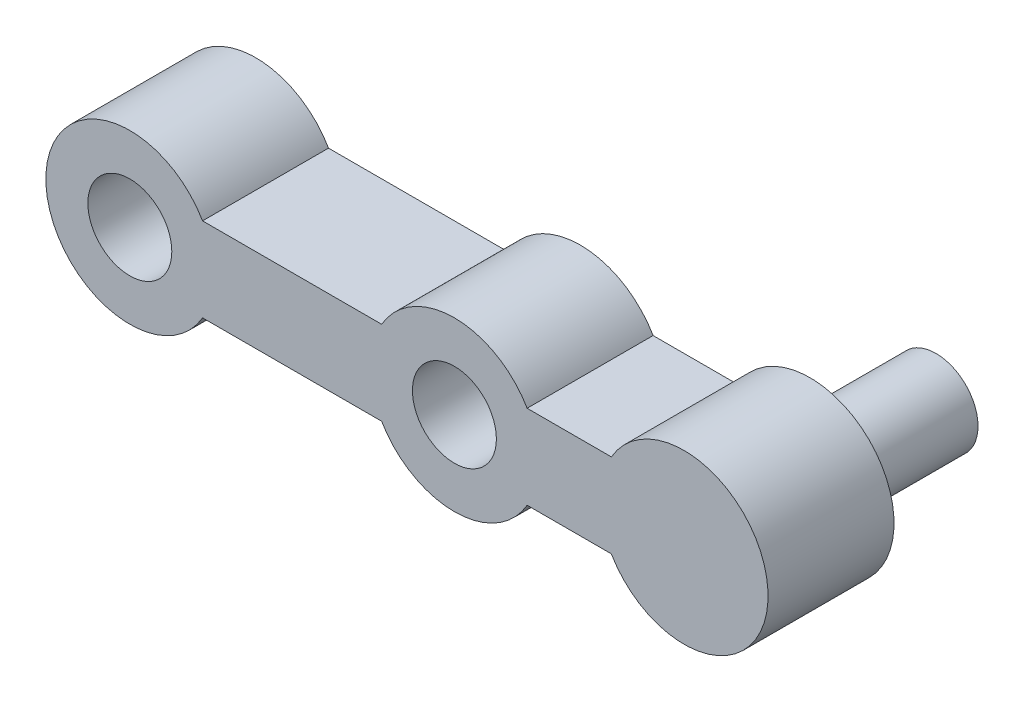
ISO-10303-21;
HEADER;
FILE_DESCRIPTION(('STEP AP214'),'2;1');
FILE_NAME('part.step','',(''),(''),'','','');
FILE_SCHEMA(('AUTOMOTIVE_DESIGN { 1 0 10303 214 1 1 1 1 }'));
ENDSEC;
DATA;
#1=APPLICATION_CONTEXT('core data for automotive mechanical design processes');
#2=APPLICATION_PROTOCOL_DEFINITION('international standard','automotive_design',2000,#1);
#3=PRODUCT_CONTEXT('',#1,'mechanical');
#4=PRODUCT('Part','Part','',(#3));
#5=PRODUCT_RELATED_PRODUCT_CATEGORY('part','',(#4));
#6=PRODUCT_DEFINITION_FORMATION('','',#4);
#7=PRODUCT_DEFINITION_CONTEXT('part definition',#1,'design');
#8=PRODUCT_DEFINITION('design','',#6,#7);
#9=PRODUCT_DEFINITION_SHAPE('','',#8);
#10=(LENGTH_UNIT() NAMED_UNIT(*) SI_UNIT(.MILLI.,.METRE.));
#11=(NAMED_UNIT(*) PLANE_ANGLE_UNIT() SI_UNIT($,.RADIAN.));
#12=(NAMED_UNIT(*) SI_UNIT($,.STERADIAN.) SOLID_ANGLE_UNIT());
#13=UNCERTAINTY_MEASURE_WITH_UNIT(LENGTH_MEASURE(1.E-05),#10,'distance_accuracy_value','');
#14=(GEOMETRIC_REPRESENTATION_CONTEXT(3) GLOBAL_UNCERTAINTY_ASSIGNED_CONTEXT((#13)) GLOBAL_UNIT_ASSIGNED_CONTEXT((#10,
#11,#12)) REPRESENTATION_CONTEXT('',''));
#15=CARTESIAN_POINT('',(0.,0.,0.));
#16=DIRECTION('',(0.,0.,1.));
#17=DIRECTION('',(1.,0.,0.));
#18=AXIS2_PLACEMENT_3D('',#15,#16,#17);
#19=CARTESIAN_POINT('',(0.,-4.82265468207547,3.));
#20=DIRECTION('',(0.,1.,0.));
#21=DIRECTION('',(0.,0.,1.));
#22=AXIS2_PLACEMENT_3D('',#19,#20,#21);
#23=PLANE('',#22);
#24=DIRECTION('',(1.,0.,0.));
#25=VECTOR('',#24,1.);
#26=CARTESIAN_POINT('',(0.,-4.82265468207547,0.));
#27=LINE('',#26,#25);
#28=CARTESIAN_POINT('',(-9.64886000168167,-4.82265468207547,0.));
#29=VERTEX_POINT('',#28);
#30=CARTESIAN_POINT('',(-7.64296161681943,-4.82265468207547,0.));
#31=VERTEX_POINT('',#30);
#32=EDGE_CURVE('E131',#29,#31,#27,.T.);
#33=ORIENTED_EDGE('',*,*,#32,.F.);
#34=DIRECTION('',(0.,0.,-1.));
#35=VECTOR('',#34,1.);
#36=CARTESIAN_POINT('',(-9.64886000168167,-4.82265468207547,3.));
#37=LINE('',#36,#35);
#38=CARTESIAN_POINT('',(-9.64886000168167,-4.82265468207547,3.));
#39=VERTEX_POINT('',#38);
#40=EDGE_CURVE('E45',#39,#29,#37,.T.);
#41=ORIENTED_EDGE('',*,*,#40,.F.);
#42=DIRECTION('',(1.,0.,0.));
#43=VECTOR('',#42,1.);
#44=CARTESIAN_POINT('',(0.,-4.82265468207547,3.));
#45=LINE('',#44,#43);
#46=CARTESIAN_POINT('',(-7.64296161681943,-4.82265468207547,3.));
#47=VERTEX_POINT('',#46);
#48=EDGE_CURVE('E149',#39,#47,#45,.T.);
#49=ORIENTED_EDGE('',*,*,#48,.T.);
#50=DIRECTION('',(0.,0.,-1.));
#51=VECTOR('',#50,1.);
#52=CARTESIAN_POINT('',(-7.64296161681943,-4.82265468207547,3.));
#53=LINE('',#52,#51);
#54=EDGE_CURVE('E89',#47,#31,#53,.T.);
#55=ORIENTED_EDGE('',*,*,#54,.T.);
#56=EDGE_LOOP('',(#33,#41,#49,#55));
#57=FACE_BOUND('',#56,.T.);
#58=ADVANCED_FACE('F37',(#57),#23,.T.);
#59=CARTESIAN_POINT('',(-11.3809108092505,-5.82265468207547,3.));
#60=DIRECTION('',(0.,0.,-1.));
#61=DIRECTION('',(-1.,0.,0.));
#62=AXIS2_PLACEMENT_3D('',#59,#60,#61);
#63=CYLINDRICAL_SURFACE('',#62,2.);
#64=CARTESIAN_POINT('',(-11.3809108092505,-5.82265468207547,0.));
#65=DIRECTION('',(0.,0.,1.));
#66=DIRECTION('',(1.,0.,0.));
#67=AXIS2_PLACEMENT_3D('',#64,#65,#66);
#68=CIRCLE('',#67,2.);
#69=CARTESIAN_POINT('',(-13.1129616168194,-4.82265468207547,0.));
#70=VERTEX_POINT('',#69);
#71=EDGE_CURVE('E134',#29,#70,#68,.T.);
#72=ORIENTED_EDGE('',*,*,#71,.T.);
#73=DIRECTION('',(0.,0.,-1.));
#74=VECTOR('',#73,1.);
#75=CARTESIAN_POINT('',(-13.1129616168194,-4.82265468207547,3.));
#76=LINE('',#75,#74);
#77=CARTESIAN_POINT('',(-13.1129616168194,-4.82265468207547,3.));
#78=VERTEX_POINT('',#77);
#79=EDGE_CURVE('E158',#78,#70,#76,.T.);
#80=ORIENTED_EDGE('',*,*,#79,.F.);
#81=CARTESIAN_POINT('',(-11.3809108092505,-5.82265468207547,3.));
#82=DIRECTION('',(0.,0.,1.));
#83=DIRECTION('',(1.,0.,0.));
#84=AXIS2_PLACEMENT_3D('',#81,#82,#83);
#85=CIRCLE('',#84,2.);
#86=EDGE_CURVE('E163',#39,#78,#85,.T.);
#87=ORIENTED_EDGE('',*,*,#86,.F.);
#88=ORIENTED_EDGE('',*,*,#40,.T.);
#89=EDGE_LOOP('',(#72,#80,#87,#88));
#90=FACE_BOUND('',#89,.T.);
#91=ADVANCED_FACE('F161',(#90),#63,.T.);
#92=CARTESIAN_POINT('',(0.,-4.82265468207548,3.));
#93=DIRECTION('',(0.,1.,0.));
#94=DIRECTION('',(-1.,0.,0.));
#95=AXIS2_PLACEMENT_3D('',#92,#93,#94);
#96=PLANE('',#95);
#97=DIRECTION('',(1.,0.,0.));
#98=VECTOR('',#97,1.);
#99=CARTESIAN_POINT('',(0.,-4.82265468207548,0.));
#100=LINE('',#99,#98);
#101=CARTESIAN_POINT('',(-17.3788600016817,-4.82265468207547,0.));
#102=VERTEX_POINT('',#101);
#103=EDGE_CURVE('E138',#102,#70,#100,.T.);
#104=ORIENTED_EDGE('',*,*,#103,.F.);
#105=DIRECTION('',(0.,0.,-1.));
#106=VECTOR('',#105,1.);
#107=CARTESIAN_POINT('',(-17.3788600016817,-4.82265468207547,3.));
#108=LINE('',#107,#106);
#109=CARTESIAN_POINT('',(-17.3788600016817,-4.82265468207547,3.));
#110=VERTEX_POINT('',#109);
#111=EDGE_CURVE('E156',#110,#102,#108,.T.);
#112=ORIENTED_EDGE('',*,*,#111,.F.);
#113=DIRECTION('',(1.,0.,0.));
#114=VECTOR('',#113,1.);
#115=CARTESIAN_POINT('',(0.,-4.82265468207548,3.));
#116=LINE('',#115,#114);
#117=EDGE_CURVE('E237',#110,#78,#116,.T.);
#118=ORIENTED_EDGE('',*,*,#117,.T.);
#119=ORIENTED_EDGE('',*,*,#79,.T.);
#120=EDGE_LOOP('',(#104,#112,#118,#119));
#121=FACE_BOUND('',#120,.T.);
#122=ADVANCED_FACE('F173',(#121),#96,.T.);
#123=CARTESIAN_POINT('',(-19.1109108092506,-5.82265468207547,3.));
#124=DIRECTION('',(0.,0.,-1.));
#125=DIRECTION('',(-1.,0.,0.));
#126=AXIS2_PLACEMENT_3D('',#123,#124,#125);
#127=CYLINDRICAL_SURFACE('',#126,2.);
#128=CARTESIAN_POINT('',(-19.1109108092506,-5.82265468207547,0.));
#129=DIRECTION('',(0.,0.,1.));
#130=DIRECTION('',(1.,0.,0.));
#131=AXIS2_PLACEMENT_3D('',#128,#129,#130);
#132=CIRCLE('',#131,2.);
#133=CARTESIAN_POINT('',(-17.3788600016817,-6.82265468207547,0.));
#134=VERTEX_POINT('',#133);
#135=EDGE_CURVE('E141',#102,#134,#132,.T.);
#136=ORIENTED_EDGE('',*,*,#135,.T.);
#137=DIRECTION('',(0.,0.,-1.));
#138=VECTOR('',#137,1.);
#139=CARTESIAN_POINT('',(-17.3788600016817,-6.82265468207547,3.));
#140=LINE('',#139,#138);
#141=CARTESIAN_POINT('',(-17.3788600016817,-6.82265468207547,3.));
#142=VERTEX_POINT('',#141);
#143=EDGE_CURVE('E153',#142,#134,#140,.T.);
#144=ORIENTED_EDGE('',*,*,#143,.F.);
#145=CARTESIAN_POINT('',(-19.1109108092506,-5.82265468207547,3.));
#146=DIRECTION('',(0.,0.,1.));
#147=DIRECTION('',(1.,0.,0.));
#148=AXIS2_PLACEMENT_3D('',#145,#146,#147);
#149=CIRCLE('',#148,2.);
#150=EDGE_CURVE('E240',#110,#142,#149,.T.);
#151=ORIENTED_EDGE('',*,*,#150,.F.);
#152=ORIENTED_EDGE('',*,*,#111,.T.);
#153=EDGE_LOOP('',(#136,#144,#151,#152));
#154=FACE_BOUND('',#153,.T.);
#155=ADVANCED_FACE('F177',(#154),#127,.T.);
#156=CARTESIAN_POINT('',(0.,-6.82265468207547,3.));
#157=DIRECTION('',(0.,1.,0.));
#158=DIRECTION('',(0.,0.,1.));
#159=AXIS2_PLACEMENT_3D('',#156,#157,#158);
#160=PLANE('',#159);
#161=DIRECTION('',(1.,0.,0.));
#162=VECTOR('',#161,1.);
#163=CARTESIAN_POINT('',(0.,-6.82265468207547,0.));
#164=LINE('',#163,#162);
#165=CARTESIAN_POINT('',(-13.1129616168194,-6.82265468207547,0.));
#166=VERTEX_POINT('',#165);
#167=EDGE_CURVE('E143',#134,#166,#164,.T.);
#168=ORIENTED_EDGE('',*,*,#167,.T.);
#169=DIRECTION('',(0.,0.,-1.));
#170=VECTOR('',#169,1.);
#171=CARTESIAN_POINT('',(-13.1129616168194,-6.82265468207547,3.));
#172=LINE('',#171,#170);
#173=CARTESIAN_POINT('',(-13.1129616168194,-6.82265468207547,3.));
#174=VERTEX_POINT('',#173);
#175=EDGE_CURVE('E123',#174,#166,#172,.T.);
#176=ORIENTED_EDGE('',*,*,#175,.F.);
#177=DIRECTION('',(1.,0.,0.));
#178=VECTOR('',#177,1.);
#179=CARTESIAN_POINT('',(0.,-6.82265468207547,3.));
#180=LINE('',#179,#178);
#181=EDGE_CURVE('E114',#142,#174,#180,.T.);
#182=ORIENTED_EDGE('',*,*,#181,.F.);
#183=ORIENTED_EDGE('',*,*,#143,.T.);
#184=EDGE_LOOP('',(#168,#176,#182,#183));
#185=FACE_BOUND('',#184,.T.);
#186=ADVANCED_FACE('F183',(#185),#160,.F.);
#187=CARTESIAN_POINT('',(-11.3809108092505,-5.82265468207547,3.));
#188=DIRECTION('',(0.,0.,-1.));
#189=DIRECTION('',(-1.,0.,0.));
#190=AXIS2_PLACEMENT_3D('',#187,#188,#189);
#191=CYLINDRICAL_SURFACE('',#190,2.);
#192=CARTESIAN_POINT('',(-11.3809108092505,-5.82265468207547,0.));
#193=DIRECTION('',(0.,0.,1.));
#194=DIRECTION('',(1.,0.,0.));
#195=AXIS2_PLACEMENT_3D('',#192,#193,#194);
#196=CIRCLE('',#195,2.);
#197=CARTESIAN_POINT('',(-9.64886000168167,-6.82265468207547,0.));
#198=VERTEX_POINT('',#197);
#199=EDGE_CURVE('E122',#166,#198,#196,.T.);
#200=ORIENTED_EDGE('',*,*,#199,.T.);
#201=DIRECTION('',(0.,0.,-1.));
#202=VECTOR('',#201,1.);
#203=CARTESIAN_POINT('',(-9.64886000168167,-6.82265468207547,3.));
#204=LINE('',#203,#202);
#205=CARTESIAN_POINT('',(-9.64886000168167,-6.82265468207547,3.));
#206=VERTEX_POINT('',#205);
#207=EDGE_CURVE('E119',#206,#198,#204,.T.);
#208=ORIENTED_EDGE('',*,*,#207,.F.);
#209=CARTESIAN_POINT('',(-11.3809108092505,-5.82265468207547,3.));
#210=DIRECTION('',(0.,0.,1.));
#211=DIRECTION('',(1.,0.,0.));
#212=AXIS2_PLACEMENT_3D('',#209,#210,#211);
#213=CIRCLE('',#212,2.);
#214=EDGE_CURVE('E108',#174,#206,#213,.T.);
#215=ORIENTED_EDGE('',*,*,#214,.F.);
#216=ORIENTED_EDGE('',*,*,#175,.T.);
#217=EDGE_LOOP('',(#200,#208,#215,#216));
#218=FACE_BOUND('',#217,.T.);
#219=ADVANCED_FACE('F120',(#218),#191,.T.);
#220=CARTESIAN_POINT('',(0.,-6.82265468207547,3.));
#221=DIRECTION('',(0.,1.,0.));
#222=DIRECTION('',(0.,0.,1.));
#223=AXIS2_PLACEMENT_3D('',#220,#221,#222);
#224=PLANE('',#223);
#225=DIRECTION('',(1.,0.,0.));
#226=VECTOR('',#225,1.);
#227=CARTESIAN_POINT('',(0.,-6.82265468207547,0.));
#228=LINE('',#227,#226);
#229=CARTESIAN_POINT('',(-7.64296161681943,-6.82265468207547,0.));
#230=VERTEX_POINT('',#229);
#231=EDGE_CURVE('E82',#198,#230,#228,.T.);
#232=ORIENTED_EDGE('',*,*,#231,.T.);
#233=DIRECTION('',(0.,0.,-1.));
#234=VECTOR('',#233,1.);
#235=CARTESIAN_POINT('',(-7.64296161681943,-6.82265468207547,3.));
#236=LINE('',#235,#234);
#237=CARTESIAN_POINT('',(-7.64296161681943,-6.82265468207547,3.));
#238=VERTEX_POINT('',#237);
#239=EDGE_CURVE('E124',#238,#230,#236,.T.);
#240=ORIENTED_EDGE('',*,*,#239,.F.);
#241=DIRECTION('',(1.,0.,0.));
#242=VECTOR('',#241,1.);
#243=CARTESIAN_POINT('',(0.,-6.82265468207547,3.));
#244=LINE('',#243,#242);
#245=EDGE_CURVE('E112',#206,#238,#244,.T.);
#246=ORIENTED_EDGE('',*,*,#245,.F.);
#247=ORIENTED_EDGE('',*,*,#207,.T.);
#248=EDGE_LOOP('',(#232,#240,#246,#247));
#249=FACE_BOUND('',#248,.T.);
#250=ADVANCED_FACE('F126',(#249),#224,.F.);
#251=CARTESIAN_POINT('',(-5.91091080925055,-5.82265468207548,3.));
#252=DIRECTION('',(0.,0.,-1.));
#253=DIRECTION('',(-1.,0.,0.));
#254=AXIS2_PLACEMENT_3D('',#251,#252,#253);
#255=CYLINDRICAL_SURFACE('',#254,2.);
#256=CARTESIAN_POINT('',(-5.91091080925055,-5.82265468207548,0.));
#257=DIRECTION('',(0.,0.,1.));
#258=DIRECTION('',(1.,0.,0.));
#259=AXIS2_PLACEMENT_3D('',#256,#257,#258);
#260=CIRCLE('',#259,2.);
#261=EDGE_CURVE('E147',#230,#31,#260,.T.);
#262=ORIENTED_EDGE('',*,*,#261,.T.);
#263=ORIENTED_EDGE('',*,*,#54,.F.);
#264=CARTESIAN_POINT('',(-5.91091080925055,-5.82265468207548,3.));
#265=DIRECTION('',(0.,0.,1.));
#266=DIRECTION('',(1.,0.,0.));
#267=AXIS2_PLACEMENT_3D('',#264,#265,#266);
#268=CIRCLE('',#267,2.);
#269=EDGE_CURVE('E53',#238,#47,#268,.T.);
#270=ORIENTED_EDGE('',*,*,#269,.F.);
#271=ORIENTED_EDGE('',*,*,#239,.T.);
#272=EDGE_LOOP('',(#262,#263,#270,#271));
#273=FACE_BOUND('',#272,.T.);
#274=ADVANCED_FACE('F192',(#273),#255,.T.);
#275=CARTESIAN_POINT('',(0.,0.,3.));
#276=DIRECTION('',(0.,0.,1.));
#277=DIRECTION('',(1.,0.,0.));
#278=AXIS2_PLACEMENT_3D('',#275,#276,#277);
#279=PLANE('',#278);
#280=CARTESIAN_POINT('',(-11.3809108092505,-5.82265468207547,3.));
#281=DIRECTION('',(0.,0.,1.));
#282=DIRECTION('',(1.,0.,0.));
#283=AXIS2_PLACEMENT_3D('',#280,#281,#282);
#284=CIRCLE('',#283,1.);
#285=CARTESIAN_POINT('',(-10.3809108092506,-5.82265468207547,3.));
#286=VERTEX_POINT('',#285);
#287=EDGE_CURVE('E228',#286,#286,#284,.T.);
#288=ORIENTED_EDGE('',*,*,#287,.F.);
#289=EDGE_LOOP('',(#288));
#290=FACE_BOUND('',#289,.T.);
#291=CARTESIAN_POINT('',(-19.1109108092506,-5.82265468207547,3.));
#292=DIRECTION('',(0.,0.,1.));
#293=DIRECTION('',(1.,0.,0.));
#294=AXIS2_PLACEMENT_3D('',#291,#292,#293);
#295=CIRCLE('',#294,1.);
#296=CARTESIAN_POINT('',(-18.1109108092505,-5.82265468207547,3.));
#297=VERTEX_POINT('',#296);
#298=EDGE_CURVE('E225',#297,#297,#295,.T.);
#299=ORIENTED_EDGE('',*,*,#298,.F.);
#300=EDGE_LOOP('',(#299));
#301=FACE_BOUND('',#300,.T.);
#302=ORIENTED_EDGE('',*,*,#48,.F.);
#303=ORIENTED_EDGE('',*,*,#86,.T.);
#304=ORIENTED_EDGE('',*,*,#117,.F.);
#305=ORIENTED_EDGE('',*,*,#150,.T.);
#306=ORIENTED_EDGE('',*,*,#181,.T.);
#307=ORIENTED_EDGE('',*,*,#214,.T.);
#308=ORIENTED_EDGE('',*,*,#245,.T.);
#309=ORIENTED_EDGE('',*,*,#269,.T.);
#310=EDGE_LOOP('',(#302,#303,#304,#305,#306,#307,#308,#309));
#311=FACE_BOUND('',#310,.T.);
#312=ADVANCED_FACE('F110',(#290,#301,#311),#279,.T.);
#313=CARTESIAN_POINT('',(0.,0.,0.));
#314=DIRECTION('',(0.,0.,1.));
#315=DIRECTION('',(1.,0.,0.));
#316=AXIS2_PLACEMENT_3D('',#313,#314,#315);
#317=PLANE('',#316);
#318=CARTESIAN_POINT('',(-5.91091080925055,-5.82265468207548,0.));
#319=DIRECTION('',(0.,0.,1.));
#320=DIRECTION('',(1.,0.,0.));
#321=AXIS2_PLACEMENT_3D('',#318,#319,#320);
#322=CIRCLE('',#321,1.);
#323=CARTESIAN_POINT('',(-4.91091080925055,-5.82265468207548,0.));
#324=VERTEX_POINT('',#323);
#325=EDGE_CURVE('E11',#324,#324,#322,.F.);
#326=ORIENTED_EDGE('',*,*,#325,.F.);
#327=EDGE_LOOP('',(#326));
#328=FACE_BOUND('',#327,.T.);
#329=CARTESIAN_POINT('',(-11.3809108092505,-5.82265468207547,0.));
#330=DIRECTION('',(0.,0.,1.));
#331=DIRECTION('',(1.,0.,0.));
#332=AXIS2_PLACEMENT_3D('',#329,#330,#331);
#333=CIRCLE('',#332,1.);
#334=CARTESIAN_POINT('',(-10.3809108092506,-5.82265468207547,0.));
#335=VERTEX_POINT('',#334);
#336=EDGE_CURVE('E135',#335,#335,#333,.F.);
#337=ORIENTED_EDGE('',*,*,#336,.F.);
#338=EDGE_LOOP('',(#337));
#339=FACE_BOUND('',#338,.T.);
#340=CARTESIAN_POINT('',(-19.1109108092506,-5.82265468207547,0.));
#341=DIRECTION('',(0.,0.,1.));
#342=DIRECTION('',(1.,0.,0.));
#343=AXIS2_PLACEMENT_3D('',#340,#341,#342);
#344=CIRCLE('',#343,1.);
#345=CARTESIAN_POINT('',(-18.1109108092505,-5.82265468207547,0.));
#346=VERTEX_POINT('',#345);
#347=EDGE_CURVE('E222',#346,#346,#344,.F.);
#348=ORIENTED_EDGE('',*,*,#347,.F.);
#349=EDGE_LOOP('',(#348));
#350=FACE_BOUND('',#349,.T.);
#351=ORIENTED_EDGE('',*,*,#32,.T.);
#352=ORIENTED_EDGE('',*,*,#261,.F.);
#353=ORIENTED_EDGE('',*,*,#231,.F.);
#354=ORIENTED_EDGE('',*,*,#199,.F.);
#355=ORIENTED_EDGE('',*,*,#167,.F.);
#356=ORIENTED_EDGE('',*,*,#135,.F.);
#357=ORIENTED_EDGE('',*,*,#103,.T.);
#358=ORIENTED_EDGE('',*,*,#71,.F.);
#359=EDGE_LOOP('',(#351,#352,#353,#354,#355,#356,#357,#358));
#360=FACE_BOUND('',#359,.T.);
#361=ADVANCED_FACE('F165',(#328,#339,#350,#360),#317,.F.);
#362=CARTESIAN_POINT('',(-19.1109108092506,-5.82265468207547,-2.82842712474619));
#363=DIRECTION('',(0.,0.,1.));
#364=DIRECTION('',(1.,0.,0.));
#365=AXIS2_PLACEMENT_3D('',#362,#363,#364);
#366=CYLINDRICAL_SURFACE('',#365,1.);
#367=ORIENTED_EDGE('',*,*,#347,.T.);
#368=EDGE_LOOP('',(#367));
#369=FACE_BOUND('',#368,.T.);
#370=ORIENTED_EDGE('',*,*,#298,.T.);
#371=EDGE_LOOP('',(#370));
#372=FACE_BOUND('',#371,.T.);
#373=ADVANCED_FACE('F198',(#369,#372),#366,.F.);
#374=CARTESIAN_POINT('',(-11.3809108092505,-5.82265468207547,-2.82842712474619));
#375=DIRECTION('',(0.,0.,1.));
#376=DIRECTION('',(1.,0.,0.));
#377=AXIS2_PLACEMENT_3D('',#374,#375,#376);
#378=CYLINDRICAL_SURFACE('',#377,1.);
#379=ORIENTED_EDGE('',*,*,#336,.T.);
#380=EDGE_LOOP('',(#379));
#381=FACE_BOUND('',#380,.T.);
#382=ORIENTED_EDGE('',*,*,#287,.T.);
#383=EDGE_LOOP('',(#382));
#384=FACE_BOUND('',#383,.T.);
#385=ADVANCED_FACE('F205',(#381,#384),#378,.F.);
#386=CARTESIAN_POINT('',(-5.91091080925055,-5.82265468207548,-3.));
#387=DIRECTION('',(0.,0.,1.));
#388=DIRECTION('',(1.,0.,0.));
#389=AXIS2_PLACEMENT_3D('',#386,#387,#388);
#390=CYLINDRICAL_SURFACE('',#389,1.);
#391=CARTESIAN_POINT('',(-5.91091080925055,-5.82265468207548,-3.));
#392=DIRECTION('',(0.,0.,-1.));
#393=DIRECTION('',(-1.,0.,0.));
#394=AXIS2_PLACEMENT_3D('',#391,#392,#393);
#395=CIRCLE('',#394,1.);
#396=CARTESIAN_POINT('',(-6.91091080925055,-5.82265468207548,-3.));
#397=VERTEX_POINT('',#396);
#398=EDGE_CURVE('E221',#397,#397,#395,.T.);
#399=ORIENTED_EDGE('',*,*,#398,.F.);
#400=EDGE_LOOP('',(#399));
#401=FACE_BOUND('',#400,.T.);
#402=ORIENTED_EDGE('',*,*,#325,.T.);
#403=EDGE_LOOP('',(#402));
#404=FACE_BOUND('',#403,.T.);
#405=ADVANCED_FACE('F209',(#401,#404),#390,.T.);
#406=CARTESIAN_POINT('',(-5.91091080925055,-5.82265468207548,-3.));
#407=DIRECTION('',(0.,0.,-1.));
#408=DIRECTION('',(-1.,0.,0.));
#409=AXIS2_PLACEMENT_3D('',#406,#407,#408);
#410=PLANE('',#409);
#411=ORIENTED_EDGE('',*,*,#398,.T.);
#412=EDGE_LOOP('',(#411));
#413=FACE_BOUND('',#412,.T.);
#414=ADVANCED_FACE('F213',(#413),#410,.T.);
#415=CLOSED_SHELL('',(#58,#91,#122,#155,#186,#219,#250,#274,#312,#361,#373,#385,#405,#414));
#416=MANIFOLD_SOLID_BREP('B2',#415);
#417=ADVANCED_BREP_SHAPE_REPRESENTATION('',(#18,#416),#14);
#418=SHAPE_DEFINITION_REPRESENTATION(#9,#417);
ENDSEC;
END-ISO-10303-21;
